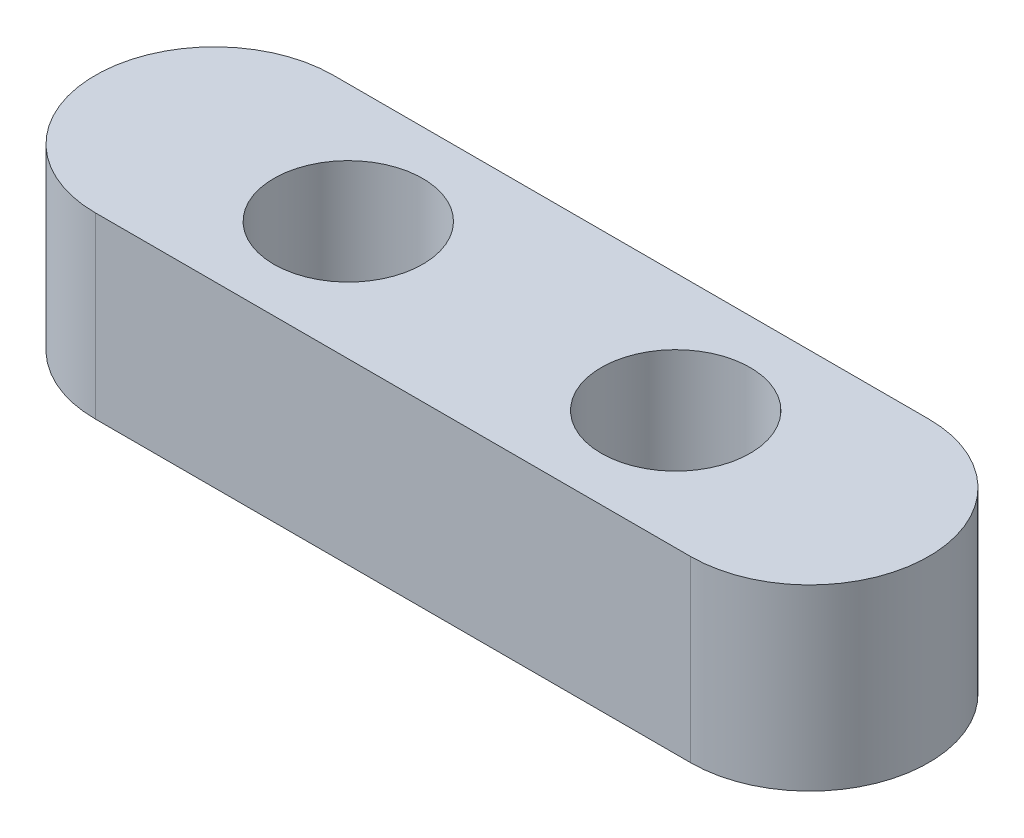
ISO-10303-21;
HEADER;
FILE_DESCRIPTION(('STEP AP214'),'2;1');
FILE_NAME('part.step','',(''),(''),'','','');
FILE_SCHEMA(('AUTOMOTIVE_DESIGN { 1 0 10303 214 1 1 1 1 }'));
ENDSEC;
DATA;
#1=APPLICATION_CONTEXT('core data for automotive mechanical design processes');
#2=APPLICATION_PROTOCOL_DEFINITION('international standard','automotive_design',2000,#1);
#3=PRODUCT_CONTEXT('',#1,'mechanical');
#4=PRODUCT('Part','Part','',(#3));
#5=PRODUCT_RELATED_PRODUCT_CATEGORY('part','',(#4));
#6=PRODUCT_DEFINITION_FORMATION('','',#4);
#7=PRODUCT_DEFINITION_CONTEXT('part definition',#1,'design');
#8=PRODUCT_DEFINITION('design','',#6,#7);
#9=PRODUCT_DEFINITION_SHAPE('','',#8);
#10=(LENGTH_UNIT() NAMED_UNIT(*) SI_UNIT(.MILLI.,.METRE.));
#11=(NAMED_UNIT(*) PLANE_ANGLE_UNIT() SI_UNIT($,.RADIAN.));
#12=(NAMED_UNIT(*) SI_UNIT($,.STERADIAN.) SOLID_ANGLE_UNIT());
#13=UNCERTAINTY_MEASURE_WITH_UNIT(LENGTH_MEASURE(1.E-05),#10,'distance_accuracy_value','');
#14=(GEOMETRIC_REPRESENTATION_CONTEXT(3) GLOBAL_UNCERTAINTY_ASSIGNED_CONTEXT((#13)) GLOBAL_UNIT_ASSIGNED_CONTEXT((#10,
#11,#12)) REPRESENTATION_CONTEXT('',''));
#15=CARTESIAN_POINT('',(0.,0.,0.));
#16=DIRECTION('',(0.,0.,1.));
#17=DIRECTION('',(1.,0.,0.));
#18=AXIS2_PLACEMENT_3D('',#15,#16,#17);
#19=CARTESIAN_POINT('',(-10.,6.,0.));
#20=DIRECTION('',(0.,1.,0.));
#21=DIRECTION('',(0.,0.,1.));
#22=AXIS2_PLACEMENT_3D('',#19,#20,#21);
#23=PLANE('',#22);
#24=CARTESIAN_POINT('',(-5.5,6.,0.));
#25=DIRECTION('',(0.,1.,0.));
#26=DIRECTION('',(0.,0.,1.));
#27=AXIS2_PLACEMENT_3D('',#24,#25,#26);
#28=CIRCLE('',#27,2.5);
#29=CARTESIAN_POINT('',(-5.5,6.,2.5));
#30=VERTEX_POINT('',#29);
#31=EDGE_CURVE('E100',#30,#30,#28,.T.);
#32=ORIENTED_EDGE('',*,*,#31,.F.);
#33=EDGE_LOOP('',(#32));
#34=FACE_BOUND('',#33,.T.);
#35=CARTESIAN_POINT('',(-10.,6.,0.));
#36=DIRECTION('',(0.,1.,0.));
#37=DIRECTION('',(0.,0.,1.));
#38=AXIS2_PLACEMENT_3D('',#35,#36,#37);
#39=CIRCLE('',#38,4.);
#40=CARTESIAN_POINT('',(-10.,6.,-4.));
#41=VERTEX_POINT('',#40);
#42=CARTESIAN_POINT('',(-10.,6.,4.));
#43=VERTEX_POINT('',#42);
#44=EDGE_CURVE('E85',#41,#43,#39,.T.);
#45=ORIENTED_EDGE('',*,*,#44,.T.);
#46=DIRECTION('',(1.,0.,0.));
#47=VECTOR('',#46,1.);
#48=CARTESIAN_POINT('',(-10.,6.,4.));
#49=LINE('',#48,#47);
#50=CARTESIAN_POINT('',(10.,6.,4.));
#51=VERTEX_POINT('',#50);
#52=EDGE_CURVE('E80',#43,#51,#49,.T.);
#53=ORIENTED_EDGE('',*,*,#52,.T.);
#54=CARTESIAN_POINT('',(10.,6.,0.));
#55=DIRECTION('',(0.,1.,0.));
#56=DIRECTION('',(0.,0.,1.));
#57=AXIS2_PLACEMENT_3D('',#54,#55,#56);
#58=CIRCLE('',#57,4.);
#59=CARTESIAN_POINT('',(10.,6.,-4.));
#60=VERTEX_POINT('',#59);
#61=EDGE_CURVE('E83',#51,#60,#58,.T.);
#62=ORIENTED_EDGE('',*,*,#61,.T.);
#63=DIRECTION('',(-1.,0.,0.));
#64=VECTOR('',#63,1.);
#65=CARTESIAN_POINT('',(-10.,6.,-4.));
#66=LINE('',#65,#64);
#67=EDGE_CURVE('E50',#60,#41,#66,.T.);
#68=ORIENTED_EDGE('',*,*,#67,.T.);
#69=EDGE_LOOP('',(#45,#53,#62,#68));
#70=FACE_BOUND('',#69,.T.);
#71=CARTESIAN_POINT('',(5.5,6.,0.));
#72=DIRECTION('',(0.,1.,0.));
#73=DIRECTION('',(0.,0.,1.));
#74=AXIS2_PLACEMENT_3D('',#71,#72,#73);
#75=CIRCLE('',#74,2.5);
#76=CARTESIAN_POINT('',(5.5,6.,2.5));
#77=VERTEX_POINT('',#76);
#78=EDGE_CURVE('E115',#77,#77,#75,.T.);
#79=ORIENTED_EDGE('',*,*,#78,.F.);
#80=EDGE_LOOP('',(#79));
#81=FACE_BOUND('',#80,.T.);
#82=ADVANCED_FACE('F33',(#34,#70,#81),#23,.T.);
#83=CARTESIAN_POINT('',(-10.,0.,0.));
#84=DIRECTION('',(0.,1.,0.));
#85=DIRECTION('',(0.,0.,1.));
#86=AXIS2_PLACEMENT_3D('',#83,#84,#85);
#87=PLANE('',#86);
#88=CARTESIAN_POINT('',(-10.,0.,0.));
#89=DIRECTION('',(0.,1.,0.));
#90=DIRECTION('',(0.,0.,1.));
#91=AXIS2_PLACEMENT_3D('',#88,#89,#90);
#92=CIRCLE('',#91,4.);
#93=CARTESIAN_POINT('',(-10.,0.,-4.));
#94=VERTEX_POINT('',#93);
#95=CARTESIAN_POINT('',(-10.,0.,4.));
#96=VERTEX_POINT('',#95);
#97=EDGE_CURVE('E97',#94,#96,#92,.T.);
#98=ORIENTED_EDGE('',*,*,#97,.F.);
#99=DIRECTION('',(-1.,0.,0.));
#100=VECTOR('',#99,1.);
#101=CARTESIAN_POINT('',(-10.,0.,-4.));
#102=LINE('',#101,#100);
#103=CARTESIAN_POINT('',(10.,0.,-4.));
#104=VERTEX_POINT('',#103);
#105=EDGE_CURVE('E73',#104,#94,#102,.T.);
#106=ORIENTED_EDGE('',*,*,#105,.F.);
#107=CARTESIAN_POINT('',(10.,0.,0.));
#108=DIRECTION('',(0.,1.,0.));
#109=DIRECTION('',(0.,0.,1.));
#110=AXIS2_PLACEMENT_3D('',#107,#108,#109);
#111=CIRCLE('',#110,4.);
#112=CARTESIAN_POINT('',(10.,0.,4.));
#113=VERTEX_POINT('',#112);
#114=EDGE_CURVE('E67',#113,#104,#111,.T.);
#115=ORIENTED_EDGE('',*,*,#114,.F.);
#116=DIRECTION('',(1.,0.,0.));
#117=VECTOR('',#116,1.);
#118=CARTESIAN_POINT('',(-10.,0.,4.));
#119=LINE('',#118,#117);
#120=EDGE_CURVE('E89',#96,#113,#119,.T.);
#121=ORIENTED_EDGE('',*,*,#120,.F.);
#122=EDGE_LOOP('',(#98,#106,#115,#121));
#123=FACE_BOUND('',#122,.T.);
#124=CARTESIAN_POINT('',(-5.5,0.,0.));
#125=DIRECTION('',(0.,1.,0.));
#126=DIRECTION('',(0.,0.,1.));
#127=AXIS2_PLACEMENT_3D('',#124,#125,#126);
#128=CIRCLE('',#127,2.5);
#129=CARTESIAN_POINT('',(-5.5,0.,2.5));
#130=VERTEX_POINT('',#129);
#131=EDGE_CURVE('E112',#130,#130,#128,.T.);
#132=ORIENTED_EDGE('',*,*,#131,.T.);
#133=EDGE_LOOP('',(#132));
#134=FACE_BOUND('',#133,.T.);
#135=CARTESIAN_POINT('',(5.5,0.,0.));
#136=DIRECTION('',(0.,1.,0.));
#137=DIRECTION('',(0.,0.,1.));
#138=AXIS2_PLACEMENT_3D('',#135,#136,#137);
#139=CIRCLE('',#138,2.5);
#140=CARTESIAN_POINT('',(5.5,0.,2.5));
#141=VERTEX_POINT('',#140);
#142=EDGE_CURVE('E118',#141,#141,#139,.T.);
#143=ORIENTED_EDGE('',*,*,#142,.T.);
#144=EDGE_LOOP('',(#143));
#145=FACE_BOUND('',#144,.T.);
#146=ADVANCED_FACE('F108',(#123,#134,#145),#87,.F.);
#147=CARTESIAN_POINT('',(-10.,6.,0.));
#148=DIRECTION('',(0.,-1.,0.));
#149=DIRECTION('',(0.,0.,-1.));
#150=AXIS2_PLACEMENT_3D('',#147,#148,#149);
#151=CYLINDRICAL_SURFACE('',#150,4.);
#152=ORIENTED_EDGE('',*,*,#97,.T.);
#153=DIRECTION('',(0.,-1.,0.));
#154=VECTOR('',#153,1.);
#155=CARTESIAN_POINT('',(-10.,6.,4.));
#156=LINE('',#155,#154);
#157=EDGE_CURVE('E11',#43,#96,#156,.T.);
#158=ORIENTED_EDGE('',*,*,#157,.F.);
#159=ORIENTED_EDGE('',*,*,#44,.F.);
#160=DIRECTION('',(0.,-1.,0.));
#161=VECTOR('',#160,1.);
#162=CARTESIAN_POINT('',(-10.,6.,-4.));
#163=LINE('',#162,#161);
#164=EDGE_CURVE('E93',#41,#94,#163,.T.);
#165=ORIENTED_EDGE('',*,*,#164,.T.);
#166=EDGE_LOOP('',(#152,#158,#159,#165));
#167=FACE_BOUND('',#166,.T.);
#168=ADVANCED_FACE('F35',(#167),#151,.T.);
#169=CARTESIAN_POINT('',(-10.,6.,4.));
#170=DIRECTION('',(0.,0.,-1.));
#171=DIRECTION('',(-1.,0.,0.));
#172=AXIS2_PLACEMENT_3D('',#169,#170,#171);
#173=PLANE('',#172);
#174=ORIENTED_EDGE('',*,*,#120,.T.);
#175=DIRECTION('',(0.,-1.,0.));
#176=VECTOR('',#175,1.);
#177=CARTESIAN_POINT('',(10.,6.,4.));
#178=LINE('',#177,#176);
#179=EDGE_CURVE('E42',#51,#113,#178,.T.);
#180=ORIENTED_EDGE('',*,*,#179,.F.);
#181=ORIENTED_EDGE('',*,*,#52,.F.);
#182=ORIENTED_EDGE('',*,*,#157,.T.);
#183=EDGE_LOOP('',(#174,#180,#181,#182));
#184=FACE_BOUND('',#183,.T.);
#185=ADVANCED_FACE('F88',(#184),#173,.F.);
#186=CARTESIAN_POINT('',(10.,6.,0.));
#187=DIRECTION('',(0.,-1.,0.));
#188=DIRECTION('',(0.,0.,-1.));
#189=AXIS2_PLACEMENT_3D('',#186,#187,#188);
#190=CYLINDRICAL_SURFACE('',#189,4.);
#191=ORIENTED_EDGE('',*,*,#114,.T.);
#192=DIRECTION('',(0.,-1.,0.));
#193=VECTOR('',#192,1.);
#194=CARTESIAN_POINT('',(10.,6.,-4.));
#195=LINE('',#194,#193);
#196=EDGE_CURVE('E90',#60,#104,#195,.T.);
#197=ORIENTED_EDGE('',*,*,#196,.F.);
#198=ORIENTED_EDGE('',*,*,#61,.F.);
#199=ORIENTED_EDGE('',*,*,#179,.T.);
#200=EDGE_LOOP('',(#191,#197,#198,#199));
#201=FACE_BOUND('',#200,.T.);
#202=ADVANCED_FACE('F91',(#201),#190,.T.);
#203=CARTESIAN_POINT('',(-10.,6.,-4.));
#204=DIRECTION('',(0.,0.,1.));
#205=DIRECTION('',(1.,0.,0.));
#206=AXIS2_PLACEMENT_3D('',#203,#204,#205);
#207=PLANE('',#206);
#208=ORIENTED_EDGE('',*,*,#105,.T.);
#209=ORIENTED_EDGE('',*,*,#164,.F.);
#210=ORIENTED_EDGE('',*,*,#67,.F.);
#211=ORIENTED_EDGE('',*,*,#196,.T.);
#212=EDGE_LOOP('',(#208,#209,#210,#211));
#213=FACE_BOUND('',#212,.T.);
#214=ADVANCED_FACE('F105',(#213),#207,.F.);
#215=CARTESIAN_POINT('',(-5.5,6.,0.));
#216=DIRECTION('',(0.,-1.,0.));
#217=DIRECTION('',(0.,0.,-1.));
#218=AXIS2_PLACEMENT_3D('',#215,#216,#217);
#219=CYLINDRICAL_SURFACE('',#218,2.5);
#220=ORIENTED_EDGE('',*,*,#31,.T.);
#221=EDGE_LOOP('',(#220));
#222=FACE_BOUND('',#221,.T.);
#223=ORIENTED_EDGE('',*,*,#131,.F.);
#224=EDGE_LOOP('',(#223));
#225=FACE_BOUND('',#224,.T.);
#226=ADVANCED_FACE('F135',(#222,#225),#219,.F.);
#227=CARTESIAN_POINT('',(5.5,6.,0.));
#228=DIRECTION('',(0.,-1.,0.));
#229=DIRECTION('',(0.,0.,-1.));
#230=AXIS2_PLACEMENT_3D('',#227,#228,#229);
#231=CYLINDRICAL_SURFACE('',#230,2.5);
#232=ORIENTED_EDGE('',*,*,#78,.T.);
#233=EDGE_LOOP('',(#232));
#234=FACE_BOUND('',#233,.T.);
#235=ORIENTED_EDGE('',*,*,#142,.F.);
#236=EDGE_LOOP('',(#235));
#237=FACE_BOUND('',#236,.T.);
#238=ADVANCED_FACE('F124',(#234,#237),#231,.F.);
#239=CLOSED_SHELL('',(#82,#146,#168,#185,#202,#214,#226,#238));
#240=MANIFOLD_SOLID_BREP('B2',#239);
#241=ADVANCED_BREP_SHAPE_REPRESENTATION('',(#18,#240),#14);
#242=SHAPE_DEFINITION_REPRESENTATION(#9,#241);
ENDSEC;
END-ISO-10303-21;
